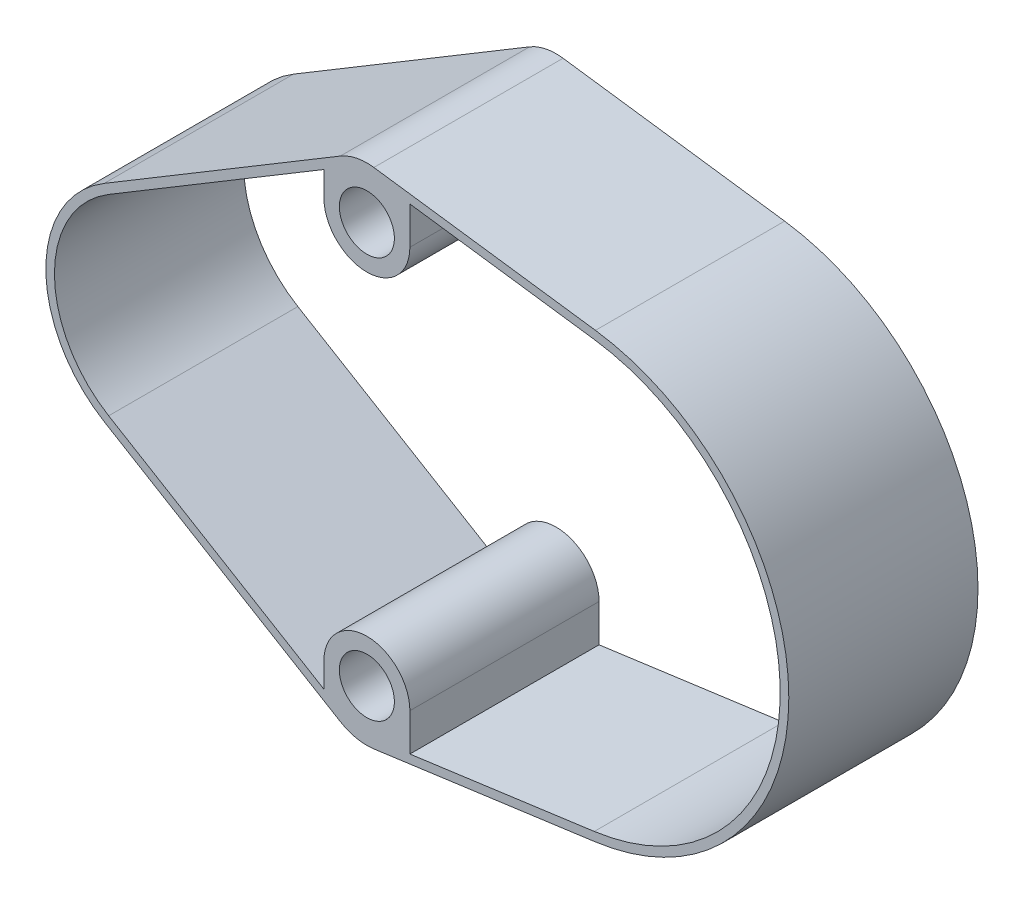
ISO-10303-21;
HEADER;
FILE_DESCRIPTION(('STEP AP214'),'2;1');
FILE_NAME('part.step','',(''),(''),'','','');
FILE_SCHEMA(('AUTOMOTIVE_DESIGN { 1 0 10303 214 1 1 1 1 }'));
ENDSEC;
DATA;
#1=APPLICATION_CONTEXT('core data for automotive mechanical design processes');
#2=APPLICATION_PROTOCOL_DEFINITION('international standard','automotive_design',2000,#1);
#3=PRODUCT_CONTEXT('',#1,'mechanical');
#4=PRODUCT('Part','Part','',(#3));
#5=PRODUCT_RELATED_PRODUCT_CATEGORY('part','',(#4));
#6=PRODUCT_DEFINITION_FORMATION('','',#4);
#7=PRODUCT_DEFINITION_CONTEXT('part definition',#1,'design');
#8=PRODUCT_DEFINITION('design','',#6,#7);
#9=PRODUCT_DEFINITION_SHAPE('','',#8);
#10=(LENGTH_UNIT() NAMED_UNIT(*) SI_UNIT(.MILLI.,.METRE.));
#11=(NAMED_UNIT(*) PLANE_ANGLE_UNIT() SI_UNIT($,.RADIAN.));
#12=(NAMED_UNIT(*) SI_UNIT($,.STERADIAN.) SOLID_ANGLE_UNIT());
#13=UNCERTAINTY_MEASURE_WITH_UNIT(LENGTH_MEASURE(1.E-05),#10,'distance_accuracy_value','');
#14=(GEOMETRIC_REPRESENTATION_CONTEXT(3) GLOBAL_UNCERTAINTY_ASSIGNED_CONTEXT((#13)) GLOBAL_UNIT_ASSIGNED_CONTEXT((#10,
#11,#12)) REPRESENTATION_CONTEXT('',''));
#15=CARTESIAN_POINT('',(0.,0.,0.));
#16=DIRECTION('',(0.,0.,1.));
#17=DIRECTION('',(1.,0.,0.));
#18=AXIS2_PLACEMENT_3D('',#15,#16,#17);
#19=CARTESIAN_POINT('',(11.667261889578,11.667261889578,1.6));
#20=DIRECTION('',(0.,0.,-1.));
#21=DIRECTION('',(-1.,0.,0.));
#22=AXIS2_PLACEMENT_3D('',#19,#20,#21);
#23=CYLINDRICAL_SURFACE('',#22,3.);
#24=DIRECTION('',(0.,0.,-1.));
#25=VECTOR('',#24,1.);
#26=CARTESIAN_POINT('',(12.0730700536144,14.6396884629355,1.6));
#27=LINE('',#26,#25);
#28=CARTESIAN_POINT('',(12.0730700536144,14.6396884629355,14.1));
#29=VERTEX_POINT('',#28);
#30=CARTESIAN_POINT('',(12.0730700536144,14.6396884629355,3.1));
#31=VERTEX_POINT('',#30);
#32=EDGE_CURVE('E139',#29,#31,#27,.T.);
#33=ORIENTED_EDGE('',*,*,#32,.T.);
#34=CARTESIAN_POINT('',(11.667261889578,11.667261889578,3.1));
#35=DIRECTION('',(0.,0.,1.));
#36=DIRECTION('',(1.,0.,0.));
#37=AXIS2_PLACEMENT_3D('',#34,#35,#36);
#38=CIRCLE('',#37,3.);
#39=CARTESIAN_POINT('',(10.1234792899552,14.239563443654,3.1));
#40=VERTEX_POINT('',#39);
#41=EDGE_CURVE('E307',#31,#40,#38,.T.);
#42=ORIENTED_EDGE('',*,*,#41,.T.);
#43=DIRECTION('',(0.,0.,1.));
#44=VECTOR('',#43,1.);
#45=CARTESIAN_POINT('',(10.1234792899552,14.239563443654,-34.868952865985));
#46=LINE('',#45,#44);
#47=CARTESIAN_POINT('',(10.1234792899552,14.239563443654,14.1));
#48=VERTEX_POINT('',#47);
#49=EDGE_CURVE('E161',#40,#48,#46,.T.);
#50=ORIENTED_EDGE('',*,*,#49,.T.);
#51=CARTESIAN_POINT('',(11.667261889578,11.667261889578,14.1));
#52=DIRECTION('',(0.,0.,1.));
#53=DIRECTION('',(1.,0.,0.));
#54=AXIS2_PLACEMENT_3D('',#51,#52,#53);
#55=CIRCLE('',#54,3.);
#56=EDGE_CURVE('E155',#29,#48,#55,.T.);
#57=ORIENTED_EDGE('',*,*,#56,.F.);
#58=EDGE_LOOP('',(#33,#42,#50,#57));
#59=FACE_BOUND('',#58,.T.);
#60=ADVANCED_FACE('F35',(#59),#23,.T.);
#61=CARTESIAN_POINT('',(11.667261889578,-11.667261889578,1.6));
#62=DIRECTION('',(0.,0.,-1.));
#63=DIRECTION('',(-1.,0.,0.));
#64=AXIS2_PLACEMENT_3D('',#61,#62,#63);
#65=CYLINDRICAL_SURFACE('',#64,3.);
#66=DIRECTION('',(0.,0.,1.));
#67=VECTOR('',#66,1.);
#68=CARTESIAN_POINT('',(10.1234792899552,-14.239563443654,-34.868952865985));
#69=LINE('',#68,#67);
#70=CARTESIAN_POINT('',(10.1234792899552,-14.239563443654,3.1));
#71=VERTEX_POINT('',#70);
#72=CARTESIAN_POINT('',(10.1234792899552,-14.239563443654,14.1));
#73=VERTEX_POINT('',#72);
#74=EDGE_CURVE('E237',#71,#73,#69,.T.);
#75=ORIENTED_EDGE('',*,*,#74,.F.);
#76=CARTESIAN_POINT('',(11.667261889578,-11.667261889578,3.1));
#77=DIRECTION('',(0.,0.,1.));
#78=DIRECTION('',(1.,0.,0.));
#79=AXIS2_PLACEMENT_3D('',#76,#77,#78);
#80=CIRCLE('',#79,3.);
#81=CARTESIAN_POINT('',(12.0730700536144,-14.6396884629355,3.1));
#82=VERTEX_POINT('',#81);
#83=EDGE_CURVE('E309',#71,#82,#80,.T.);
#84=ORIENTED_EDGE('',*,*,#83,.T.);
#85=DIRECTION('',(0.,0.,-1.));
#86=VECTOR('',#85,1.);
#87=CARTESIAN_POINT('',(12.0730700536144,-14.6396884629355,1.6));
#88=LINE('',#87,#86);
#89=CARTESIAN_POINT('',(12.0730700536144,-14.6396884629355,14.1));
#90=VERTEX_POINT('',#89);
#91=EDGE_CURVE('E11',#90,#82,#88,.T.);
#92=ORIENTED_EDGE('',*,*,#91,.F.);
#93=CARTESIAN_POINT('',(11.667261889578,-11.667261889578,14.1));
#94=DIRECTION('',(0.,0.,1.));
#95=DIRECTION('',(1.,0.,0.));
#96=AXIS2_PLACEMENT_3D('',#93,#94,#95);
#97=CIRCLE('',#96,3.);
#98=EDGE_CURVE('E254',#73,#90,#97,.T.);
#99=ORIENTED_EDGE('',*,*,#98,.F.);
#100=EDGE_LOOP('',(#75,#84,#92,#99));
#101=FACE_BOUND('',#100,.T.);
#102=ADVANCED_FACE('F334',(#101),#65,.T.);
#103=CARTESIAN_POINT('',(12.0730700536144,-14.6396884629355,1.6));
#104=DIRECTION('',(-0.135269388012114,0.990808857785813,0.));
#105=DIRECTION('',(-0.990808857785813,-0.135269388012114,0.));
#106=AXIS2_PLACEMENT_3D('',#103,#104,#105);
#107=PLANE('',#106);
#108=ORIENTED_EDGE('',*,*,#91,.T.);
#109=DIRECTION('',(0.990808857785813,0.135269388012114,0.));
#110=VECTOR('',#109,1.);
#111=CARTESIAN_POINT('',(12.0730700536144,-14.6396884629355,3.1));
#112=LINE('',#111,#110);
#113=CARTESIAN_POINT('',(24.9585020441575,-12.8805151512156,3.1));
#114=VERTEX_POINT('',#113);
#115=EDGE_CURVE('E250',#82,#114,#112,.T.);
#116=ORIENTED_EDGE('',*,*,#115,.T.);
#117=DIRECTION('',(0.,0.,-1.));
#118=VECTOR('',#117,1.);
#119=CARTESIAN_POINT('',(24.9585020441575,-12.8805151512156,1.6));
#120=LINE('',#119,#118);
#121=CARTESIAN_POINT('',(24.9585020441575,-12.8805151512156,14.1));
#122=VERTEX_POINT('',#121);
#123=EDGE_CURVE('E42',#122,#114,#120,.T.);
#124=ORIENTED_EDGE('',*,*,#123,.F.);
#125=DIRECTION('',(0.990808857785813,0.135269388012114,0.));
#126=VECTOR('',#125,1.);
#127=CARTESIAN_POINT('',(2.18301117428707,-15.9899208528639,14.1));
#128=LINE('',#127,#126);
#129=EDGE_CURVE('E249',#90,#122,#128,.T.);
#130=ORIENTED_EDGE('',*,*,#129,.F.);
#131=EDGE_LOOP('',(#108,#116,#124,#130));
#132=FACE_BOUND('',#131,.T.);
#133=ADVANCED_FACE('F248',(#132),#107,.F.);
#134=CARTESIAN_POINT('',(23.2,0.,1.6));
#135=DIRECTION('',(0.,0.,-1.));
#136=DIRECTION('',(-1.,0.,0.));
#137=AXIS2_PLACEMENT_3D('',#134,#135,#136);
#138=CYLINDRICAL_SURFACE('',#137,13.);
#139=ORIENTED_EDGE('',*,*,#123,.T.);
#140=CARTESIAN_POINT('',(23.2,0.,3.1));
#141=DIRECTION('',(0.,0.,1.));
#142=DIRECTION('',(1.,0.,0.));
#143=AXIS2_PLACEMENT_3D('',#140,#141,#142);
#144=CIRCLE('',#143,13.);
#145=CARTESIAN_POINT('',(24.9585020441575,12.8805151512156,3.1));
#146=VERTEX_POINT('',#145);
#147=EDGE_CURVE('E82',#114,#146,#144,.T.);
#148=ORIENTED_EDGE('',*,*,#147,.T.);
#149=DIRECTION('',(0.,0.,-1.));
#150=VECTOR('',#149,1.);
#151=CARTESIAN_POINT('',(24.9585020441575,12.8805151512156,1.6));
#152=LINE('',#151,#150);
#153=CARTESIAN_POINT('',(24.9585020441575,12.8805151512156,14.1));
#154=VERTEX_POINT('',#153);
#155=EDGE_CURVE('E148',#154,#146,#152,.T.);
#156=ORIENTED_EDGE('',*,*,#155,.F.);
#157=CARTESIAN_POINT('',(23.2,0.,14.1));
#158=DIRECTION('',(0.,0.,1.));
#159=DIRECTION('',(1.,0.,0.));
#160=AXIS2_PLACEMENT_3D('',#157,#158,#159);
#161=CIRCLE('',#160,13.);
#162=EDGE_CURVE('E158',#122,#154,#161,.T.);
#163=ORIENTED_EDGE('',*,*,#162,.F.);
#164=EDGE_LOOP('',(#139,#148,#156,#163));
#165=FACE_BOUND('',#164,.T.);
#166=ADVANCED_FACE('F245',(#165),#138,.T.);
#167=CARTESIAN_POINT('',(12.0730700536144,14.6396884629355,1.6));
#168=DIRECTION('',(-0.135269388012114,-0.990808857785813,0.));
#169=DIRECTION('',(0.990808857785813,-0.135269388012114,0.));
#170=AXIS2_PLACEMENT_3D('',#167,#168,#169);
#171=PLANE('',#170);
#172=ORIENTED_EDGE('',*,*,#155,.T.);
#173=DIRECTION('',(-0.990808857785813,0.135269388012114,0.));
#174=VECTOR('',#173,1.);
#175=CARTESIAN_POINT('',(12.0730700536144,14.6396884629355,3.1));
#176=LINE('',#175,#174);
#177=EDGE_CURVE('E144',#146,#31,#176,.T.);
#178=ORIENTED_EDGE('',*,*,#177,.T.);
#179=ORIENTED_EDGE('',*,*,#32,.F.);
#180=DIRECTION('',(-0.990808857785813,0.135269388012114,0.));
#181=VECTOR('',#180,1.);
#182=CARTESIAN_POINT('',(2.18301117428706,15.9899208528639,14.1));
#183=LINE('',#182,#181);
#184=EDGE_CURVE('E143',#154,#29,#183,.T.);
#185=ORIENTED_EDGE('',*,*,#184,.F.);
#186=EDGE_LOOP('',(#172,#178,#179,#185));
#187=FACE_BOUND('',#186,.T.);
#188=ADVANCED_FACE('F142',(#187),#171,.F.);
#189=CARTESIAN_POINT('',(11.667261889578,11.667261889578,1.6));
#190=DIRECTION('',(0.,0.,-1.));
#191=DIRECTION('',(-1.,0.,0.));
#192=AXIS2_PLACEMENT_3D('',#189,#190,#191);
#193=CYLINDRICAL_SURFACE('',#192,1.6);
#194=CARTESIAN_POINT('',(11.667261889578,11.667261889578,3.1));
#195=DIRECTION('',(0.,0.,1.));
#196=DIRECTION('',(1.,0.,0.));
#197=AXIS2_PLACEMENT_3D('',#194,#195,#196);
#198=CIRCLE('',#197,1.6);
#199=CARTESIAN_POINT('',(13.267261889578,11.667261889578,3.1));
#200=VERTEX_POINT('',#199);
#201=EDGE_CURVE('E170',#200,#200,#198,.T.);
#202=ORIENTED_EDGE('',*,*,#201,.F.);
#203=EDGE_LOOP('',(#202));
#204=FACE_BOUND('',#203,.T.);
#205=CARTESIAN_POINT('',(11.667261889578,11.667261889578,14.1));
#206=DIRECTION('',(0.,0.,1.));
#207=DIRECTION('',(1.,0.,0.));
#208=AXIS2_PLACEMENT_3D('',#205,#206,#207);
#209=CIRCLE('',#208,1.6);
#210=CARTESIAN_POINT('',(13.267261889578,11.667261889578,14.1));
#211=VERTEX_POINT('',#210);
#212=EDGE_CURVE('E265',#211,#211,#209,.F.);
#213=ORIENTED_EDGE('',*,*,#212,.F.);
#214=EDGE_LOOP('',(#213));
#215=FACE_BOUND('',#214,.T.);
#216=ADVANCED_FACE('F421',(#204,#215),#193,.F.);
#217=CARTESIAN_POINT('',(11.667261889578,-11.667261889578,1.6));
#218=DIRECTION('',(0.,0.,-1.));
#219=DIRECTION('',(-1.,0.,0.));
#220=AXIS2_PLACEMENT_3D('',#217,#218,#219);
#221=CYLINDRICAL_SURFACE('',#220,1.6);
#222=CARTESIAN_POINT('',(11.667261889578,-11.667261889578,3.1));
#223=DIRECTION('',(0.,0.,1.));
#224=DIRECTION('',(1.,0.,0.));
#225=AXIS2_PLACEMENT_3D('',#222,#223,#224);
#226=CIRCLE('',#225,1.6);
#227=CARTESIAN_POINT('',(13.267261889578,-11.667261889578,3.1));
#228=VERTEX_POINT('',#227);
#229=EDGE_CURVE('E301',#228,#228,#226,.T.);
#230=ORIENTED_EDGE('',*,*,#229,.F.);
#231=EDGE_LOOP('',(#230));
#232=FACE_BOUND('',#231,.T.);
#233=CARTESIAN_POINT('',(11.667261889578,-11.667261889578,14.1));
#234=DIRECTION('',(0.,0.,1.));
#235=DIRECTION('',(1.,0.,0.));
#236=AXIS2_PLACEMENT_3D('',#233,#234,#235);
#237=CIRCLE('',#236,1.6);
#238=CARTESIAN_POINT('',(13.267261889578,-11.667261889578,14.1));
#239=VERTEX_POINT('',#238);
#240=EDGE_CURVE('E262',#239,#239,#237,.F.);
#241=ORIENTED_EDGE('',*,*,#240,.F.);
#242=EDGE_LOOP('',(#241));
#243=FACE_BOUND('',#242,.T.);
#244=ADVANCED_FACE('F419',(#232,#243),#221,.F.);
#245=CARTESIAN_POINT('',(-3.60215939911994,-6.00203695951065,-34.868952865985));
#246=DIRECTION('',(-0.514594199874278,-0.857433851358664,0.));
#247=DIRECTION('',(0.857433851358664,-0.514594199874278,0.));
#248=AXIS2_PLACEMENT_3D('',#245,#246,#247);
#249=PLANE('',#248);
#250=DIRECTION('',(-0.857433851358664,0.514594199874278,0.));
#251=VECTOR('',#250,1.);
#252=CARTESIAN_POINT('',(-3.60215939911994,-6.00203695951065,3.1));
#253=LINE('',#252,#251);
#254=CARTESIAN_POINT('',(-3.60215939911994,-6.00203695951065,3.1));
#255=VERTEX_POINT('',#254);
#256=EDGE_CURVE('E312',#71,#255,#253,.T.);
#257=ORIENTED_EDGE('',*,*,#256,.F.);
#258=ORIENTED_EDGE('',*,*,#74,.T.);
#259=DIRECTION('',(0.857433851358665,-0.514594199874278,0.));
#260=VECTOR('',#259,1.);
#261=CARTESIAN_POINT('',(-3.60215939911994,-6.00203695951065,14.1));
#262=LINE('',#261,#260);
#263=CARTESIAN_POINT('',(-3.60215939911994,-6.00203695951065,14.1));
#264=VERTEX_POINT('',#263);
#265=EDGE_CURVE('E256',#264,#73,#262,.T.);
#266=ORIENTED_EDGE('',*,*,#265,.F.);
#267=DIRECTION('',(0.,0.,1.));
#268=VECTOR('',#267,1.);
#269=CARTESIAN_POINT('',(-3.60215939911994,-6.00203695951065,-34.868952865985));
#270=LINE('',#269,#268);
#271=EDGE_CURVE('E239',#255,#264,#270,.T.);
#272=ORIENTED_EDGE('',*,*,#271,.F.);
#273=EDGE_LOOP('',(#257,#258,#266,#272));
#274=FACE_BOUND('',#273,.T.);
#275=ADVANCED_FACE('F331',(#274),#249,.T.);
#276=CARTESIAN_POINT('',(0.,0.,-34.868952865985));
#277=DIRECTION('',(0.,0.,1.));
#278=DIRECTION('',(1.,0.,0.));
#279=AXIS2_PLACEMENT_3D('',#276,#277,#278);
#280=CYLINDRICAL_SURFACE('',#279,7.);
#281=CARTESIAN_POINT('',(0.,0.,3.1));
#282=DIRECTION('',(0.,0.,1.));
#283=DIRECTION('',(1.,0.,0.));
#284=AXIS2_PLACEMENT_3D('',#281,#282,#283);
#285=CIRCLE('',#284,7.);
#286=CARTESIAN_POINT('',(-3.60215939911994,6.00203695951065,3.1));
#287=VERTEX_POINT('',#286);
#288=EDGE_CURVE('E49',#255,#287,#285,.F.);
#289=ORIENTED_EDGE('',*,*,#288,.F.);
#290=ORIENTED_EDGE('',*,*,#271,.T.);
#291=CARTESIAN_POINT('',(0.,0.,14.1));
#292=DIRECTION('',(0.,0.,1.));
#293=DIRECTION('',(1.,0.,0.));
#294=AXIS2_PLACEMENT_3D('',#291,#292,#293);
#295=CIRCLE('',#294,7.);
#296=CARTESIAN_POINT('',(-3.60215939911994,6.00203695951065,14.1));
#297=VERTEX_POINT('',#296);
#298=EDGE_CURVE('E260',#297,#264,#295,.T.);
#299=ORIENTED_EDGE('',*,*,#298,.F.);
#300=DIRECTION('',(0.,0.,1.));
#301=VECTOR('',#300,1.);
#302=CARTESIAN_POINT('',(-3.60215939911994,6.00203695951065,-34.868952865985));
#303=LINE('',#302,#301);
#304=EDGE_CURVE('E57',#287,#297,#303,.T.);
#305=ORIENTED_EDGE('',*,*,#304,.F.);
#306=EDGE_LOOP('',(#289,#290,#299,#305));
#307=FACE_BOUND('',#306,.T.);
#308=ADVANCED_FACE('F326',(#307),#280,.T.);
#309=CARTESIAN_POINT('',(-3.60215939911994,6.00203695951065,-34.868952865985));
#310=DIRECTION('',(-0.514594199874278,0.857433851358664,0.));
#311=DIRECTION('',(-0.857433851358664,-0.514594199874278,0.));
#312=AXIS2_PLACEMENT_3D('',#309,#310,#311);
#313=PLANE('',#312);
#314=DIRECTION('',(0.857433851358664,0.514594199874278,0.));
#315=VECTOR('',#314,1.);
#316=CARTESIAN_POINT('',(-3.60215939911994,6.00203695951065,3.1));
#317=LINE('',#316,#315);
#318=EDGE_CURVE('E315',#287,#40,#317,.T.);
#319=ORIENTED_EDGE('',*,*,#318,.F.);
#320=ORIENTED_EDGE('',*,*,#304,.T.);
#321=DIRECTION('',(-0.857433851358665,-0.514594199874278,0.));
#322=VECTOR('',#321,1.);
#323=CARTESIAN_POINT('',(-3.60215939911994,6.00203695951065,14.1));
#324=LINE('',#323,#322);
#325=EDGE_CURVE('E162',#48,#297,#324,.T.);
#326=ORIENTED_EDGE('',*,*,#325,.F.);
#327=ORIENTED_EDGE('',*,*,#49,.F.);
#328=EDGE_LOOP('',(#319,#320,#326,#327));
#329=FACE_BOUND('',#328,.T.);
#330=ADVANCED_FACE('F323',(#329),#313,.T.);
#331=CARTESIAN_POINT('',(11.667261889578,-11.667261889578,14.1));
#332=DIRECTION('',(0.,0.,-1.));
#333=DIRECTION('',(-1.,0.,0.));
#334=AXIS2_PLACEMENT_3D('',#331,#332,#333);
#335=CYLINDRICAL_SURFACE('',#334,2.5);
#336=CARTESIAN_POINT('',(11.667261889578,-11.667261889578,3.1));
#337=DIRECTION('',(0.,0.,1.));
#338=DIRECTION('',(1.,0.,0.));
#339=AXIS2_PLACEMENT_3D('',#336,#337,#338);
#340=CIRCLE('',#339,2.5);
#341=CARTESIAN_POINT('',(9.16726188957803,-11.667261889578,3.1));
#342=VERTEX_POINT('',#341);
#343=CARTESIAN_POINT('',(14.167261889578,-11.667261889578,3.1));
#344=VERTEX_POINT('',#343);
#345=EDGE_CURVE('E71',#342,#344,#340,.F.);
#346=ORIENTED_EDGE('',*,*,#345,.F.);
#347=DIRECTION('',(0.,0.,-1.));
#348=VECTOR('',#347,1.);
#349=CARTESIAN_POINT('',(9.16726188957803,-11.667261889578,14.1));
#350=LINE('',#349,#348);
#351=CARTESIAN_POINT('',(9.16726188957803,-11.667261889578,14.1));
#352=VERTEX_POINT('',#351);
#353=EDGE_CURVE('E234',#352,#342,#350,.T.);
#354=ORIENTED_EDGE('',*,*,#353,.F.);
#355=CARTESIAN_POINT('',(11.667261889578,-11.667261889578,14.1));
#356=DIRECTION('',(0.,0.,1.));
#357=DIRECTION('',(1.,0.,0.));
#358=AXIS2_PLACEMENT_3D('',#355,#356,#357);
#359=CIRCLE('',#358,2.5);
#360=CARTESIAN_POINT('',(14.167261889578,-11.667261889578,14.1));
#361=VERTEX_POINT('',#360);
#362=EDGE_CURVE('E202',#352,#361,#359,.F.);
#363=ORIENTED_EDGE('',*,*,#362,.T.);
#364=DIRECTION('',(0.,0.,-1.));
#365=VECTOR('',#364,1.);
#366=CARTESIAN_POINT('',(14.167261889578,-11.667261889578,14.1));
#367=LINE('',#366,#365);
#368=EDGE_CURVE('E164',#361,#344,#367,.T.);
#369=ORIENTED_EDGE('',*,*,#368,.T.);
#370=EDGE_LOOP('',(#346,#354,#363,#369));
#371=FACE_BOUND('',#370,.T.);
#372=ADVANCED_FACE('F410',(#371),#335,.T.);
#373=CARTESIAN_POINT('',(9.16726188957916,-8.86829933341991E-13,14.1));
#374=DIRECTION('',(1.,0.,0.));
#375=DIRECTION('',(0.,1.,0.));
#376=AXIS2_PLACEMENT_3D('',#373,#374,#375);
#377=PLANE('',#376);
#378=DIRECTION('',(0.,-1.,0.));
#379=VECTOR('',#378,1.);
#380=CARTESIAN_POINT('',(9.16726188957916,-8.86829933341991E-13,3.1));
#381=LINE('',#380,#379);
#382=CARTESIAN_POINT('',(9.1672618895779,-13.0838925660797,3.1));
#383=VERTEX_POINT('',#382);
#384=EDGE_CURVE('E169',#342,#383,#381,.T.);
#385=ORIENTED_EDGE('',*,*,#384,.T.);
#386=DIRECTION('',(0.,0.,-1.));
#387=VECTOR('',#386,1.);
#388=CARTESIAN_POINT('',(9.1672618895779,-13.0838925660797,14.1));
#389=LINE('',#388,#387);
#390=CARTESIAN_POINT('',(9.1672618895779,-13.0838925660797,14.1));
#391=VERTEX_POINT('',#390);
#392=EDGE_CURVE('E231',#391,#383,#389,.T.);
#393=ORIENTED_EDGE('',*,*,#392,.F.);
#394=DIRECTION('',(0.,-1.,0.));
#395=VECTOR('',#394,1.);
#396=CARTESIAN_POINT('',(9.16726188957916,-8.86829933341991E-13,14.1));
#397=LINE('',#396,#395);
#398=EDGE_CURVE('E295',#352,#391,#397,.T.);
#399=ORIENTED_EDGE('',*,*,#398,.F.);
#400=ORIENTED_EDGE('',*,*,#353,.T.);
#401=EDGE_LOOP('',(#385,#393,#399,#400));
#402=FACE_BOUND('',#401,.T.);
#403=ADVANCED_FACE('F407',(#402),#377,.F.);
#404=CARTESIAN_POINT('',(-3.34534100876561,-5.57337126377146,14.1));
#405=DIRECTION('',(0.51464486434892,0.857403442726516,0.));
#406=DIRECTION('',(-0.857403442726516,0.51464486434892,0.));
#407=AXIS2_PLACEMENT_3D('',#404,#405,#406);
#408=PLANE('',#407);
#409=DIRECTION('',(0.857403442726516,-0.51464486434892,0.));
#410=VECTOR('',#409,1.);
#411=CARTESIAN_POINT('',(-3.34534100876561,-5.57337126377146,3.1));
#412=LINE('',#411,#410);
#413=CARTESIAN_POINT('',(-3.34534100876558,-5.57337126377148,3.1));
#414=VERTEX_POINT('',#413);
#415=EDGE_CURVE('E173',#414,#383,#412,.T.);
#416=ORIENTED_EDGE('',*,*,#415,.F.);
#417=DIRECTION('',(0.,0.,-1.));
#418=VECTOR('',#417,1.);
#419=CARTESIAN_POINT('',(-3.34534100876558,-5.57337126377148,14.1));
#420=LINE('',#419,#418);
#421=CARTESIAN_POINT('',(-3.34534100876558,-5.57337126377148,14.1));
#422=VERTEX_POINT('',#421);
#423=EDGE_CURVE('E228',#422,#414,#420,.T.);
#424=ORIENTED_EDGE('',*,*,#423,.F.);
#425=DIRECTION('',(0.857403442726516,-0.51464486434892,0.));
#426=VECTOR('',#425,1.);
#427=CARTESIAN_POINT('',(-3.34534100876561,-5.57337126377146,14.1));
#428=LINE('',#427,#426);
#429=EDGE_CURVE('E292',#422,#391,#428,.T.);
#430=ORIENTED_EDGE('',*,*,#429,.T.);
#431=ORIENTED_EDGE('',*,*,#392,.T.);
#432=EDGE_LOOP('',(#416,#424,#430,#431));
#433=FACE_BOUND('',#432,.T.);
#434=ADVANCED_FACE('F403',(#433),#408,.T.);
#435=CARTESIAN_POINT('',(0.,0.,14.1));
#436=DIRECTION('',(0.,0.,-1.));
#437=DIRECTION('',(-1.,0.,0.));
#438=AXIS2_PLACEMENT_3D('',#435,#436,#437);
#439=CYLINDRICAL_SURFACE('',#438,6.50029027880774);
#440=CARTESIAN_POINT('',(0.,0.,3.1));
#441=DIRECTION('',(0.,0.,1.));
#442=DIRECTION('',(1.,0.,0.));
#443=AXIS2_PLACEMENT_3D('',#440,#441,#442);
#444=CIRCLE('',#443,6.50029027880774);
#445=CARTESIAN_POINT('',(-3.3453410087655,5.57337126377152,3.1));
#446=VERTEX_POINT('',#445);
#447=EDGE_CURVE('E176',#446,#414,#444,.T.);
#448=ORIENTED_EDGE('',*,*,#447,.F.);
#449=DIRECTION('',(0.,0.,-1.));
#450=VECTOR('',#449,1.);
#451=CARTESIAN_POINT('',(-3.3453410087655,5.57337126377152,14.1));
#452=LINE('',#451,#450);
#453=CARTESIAN_POINT('',(-3.3453410087655,5.57337126377152,14.1));
#454=VERTEX_POINT('',#453);
#455=EDGE_CURVE('E225',#454,#446,#452,.T.);
#456=ORIENTED_EDGE('',*,*,#455,.F.);
#457=CARTESIAN_POINT('',(0.,0.,14.1));
#458=DIRECTION('',(0.,0.,1.));
#459=DIRECTION('',(1.,0.,0.));
#460=AXIS2_PLACEMENT_3D('',#457,#458,#459);
#461=CIRCLE('',#460,6.50029027880774);
#462=EDGE_CURVE('E289',#454,#422,#461,.T.);
#463=ORIENTED_EDGE('',*,*,#462,.T.);
#464=ORIENTED_EDGE('',*,*,#423,.T.);
#465=EDGE_LOOP('',(#448,#456,#463,#464));
#466=FACE_BOUND('',#465,.T.);
#467=ADVANCED_FACE('F399',(#466),#439,.F.);
#468=CARTESIAN_POINT('',(-3.34534100876558,5.57337126377147,14.1));
#469=DIRECTION('',(0.514644864348916,-0.857403442726518,0.));
#470=DIRECTION('',(0.857403442726518,0.514644864348916,0.));
#471=AXIS2_PLACEMENT_3D('',#468,#469,#470);
#472=PLANE('',#471);
#473=DIRECTION('',(-0.857403442726518,-0.514644864348916,0.));
#474=VECTOR('',#473,1.);
#475=CARTESIAN_POINT('',(-3.34534100876558,5.57337126377147,3.1));
#476=LINE('',#475,#474);
#477=CARTESIAN_POINT('',(9.16726188957793,13.0838925660796,3.1));
#478=VERTEX_POINT('',#477);
#479=EDGE_CURVE('E179',#478,#446,#476,.T.);
#480=ORIENTED_EDGE('',*,*,#479,.F.);
#481=DIRECTION('',(0.,0.,-1.));
#482=VECTOR('',#481,1.);
#483=CARTESIAN_POINT('',(9.16726188957793,13.0838925660796,14.1));
#484=LINE('',#483,#482);
#485=CARTESIAN_POINT('',(9.16726188957793,13.0838925660796,14.1));
#486=VERTEX_POINT('',#485);
#487=EDGE_CURVE('E222',#486,#478,#484,.T.);
#488=ORIENTED_EDGE('',*,*,#487,.F.);
#489=DIRECTION('',(-0.857403442726518,-0.514644864348916,0.));
#490=VECTOR('',#489,1.);
#491=CARTESIAN_POINT('',(-3.34534100876558,5.57337126377147,14.1));
#492=LINE('',#491,#490);
#493=EDGE_CURVE('E286',#486,#454,#492,.T.);
#494=ORIENTED_EDGE('',*,*,#493,.T.);
#495=ORIENTED_EDGE('',*,*,#455,.T.);
#496=EDGE_LOOP('',(#480,#488,#494,#495));
#497=FACE_BOUND('',#496,.T.);
#498=ADVANCED_FACE('F395',(#497),#472,.T.);
#499=CARTESIAN_POINT('',(9.16726188957886,6.5109033080805E-13,14.1));
#500=DIRECTION('',(-1.,0.,0.));
#501=DIRECTION('',(0.,-1.,0.));
#502=AXIS2_PLACEMENT_3D('',#499,#500,#501);
#503=PLANE('',#502);
#504=DIRECTION('',(0.,1.,0.));
#505=VECTOR('',#504,1.);
#506=CARTESIAN_POINT('',(9.16726188957886,6.5109033080805E-13,3.1));
#507=LINE('',#506,#505);
#508=CARTESIAN_POINT('',(9.16726188957803,11.667261889578,3.1));
#509=VERTEX_POINT('',#508);
#510=EDGE_CURVE('E182',#509,#478,#507,.T.);
#511=ORIENTED_EDGE('',*,*,#510,.F.);
#512=DIRECTION('',(0.,0.,-1.));
#513=VECTOR('',#512,1.);
#514=CARTESIAN_POINT('',(9.16726188957803,11.667261889578,14.1));
#515=LINE('',#514,#513);
#516=CARTESIAN_POINT('',(9.16726188957803,11.667261889578,14.1));
#517=VERTEX_POINT('',#516);
#518=EDGE_CURVE('E219',#517,#509,#515,.T.);
#519=ORIENTED_EDGE('',*,*,#518,.F.);
#520=DIRECTION('',(0.,1.,0.));
#521=VECTOR('',#520,1.);
#522=CARTESIAN_POINT('',(9.16726188957886,6.5109033080805E-13,14.1));
#523=LINE('',#522,#521);
#524=EDGE_CURVE('E283',#517,#486,#523,.T.);
#525=ORIENTED_EDGE('',*,*,#524,.T.);
#526=ORIENTED_EDGE('',*,*,#487,.T.);
#527=EDGE_LOOP('',(#511,#519,#525,#526));
#528=FACE_BOUND('',#527,.T.);
#529=ADVANCED_FACE('F392',(#528),#503,.T.);
#530=CARTESIAN_POINT('',(11.667261889578,11.667261889578,14.1));
#531=DIRECTION('',(0.,0.,-1.));
#532=DIRECTION('',(-1.,0.,0.));
#533=AXIS2_PLACEMENT_3D('',#530,#531,#532);
#534=CYLINDRICAL_SURFACE('',#533,2.5);
#535=CARTESIAN_POINT('',(11.667261889578,11.667261889578,3.1));
#536=DIRECTION('',(0.,0.,1.));
#537=DIRECTION('',(1.,0.,0.));
#538=AXIS2_PLACEMENT_3D('',#535,#536,#537);
#539=CIRCLE('',#538,2.5);
#540=CARTESIAN_POINT('',(14.167261889578,11.667261889578,3.1));
#541=VERTEX_POINT('',#540);
#542=EDGE_CURVE('E185',#509,#541,#539,.T.);
#543=ORIENTED_EDGE('',*,*,#542,.T.);
#544=DIRECTION('',(0.,0.,-1.));
#545=VECTOR('',#544,1.);
#546=CARTESIAN_POINT('',(14.167261889578,11.667261889578,14.1));
#547=LINE('',#546,#545);
#548=CARTESIAN_POINT('',(14.167261889578,11.667261889578,14.1));
#549=VERTEX_POINT('',#548);
#550=EDGE_CURVE('E216',#549,#541,#547,.T.);
#551=ORIENTED_EDGE('',*,*,#550,.F.);
#552=CARTESIAN_POINT('',(11.667261889578,11.667261889578,14.1));
#553=DIRECTION('',(0.,0.,1.));
#554=DIRECTION('',(1.,0.,0.));
#555=AXIS2_PLACEMENT_3D('',#552,#553,#554);
#556=CIRCLE('',#555,2.5);
#557=EDGE_CURVE('E281',#517,#549,#556,.T.);
#558=ORIENTED_EDGE('',*,*,#557,.F.);
#559=ORIENTED_EDGE('',*,*,#518,.T.);
#560=EDGE_LOOP('',(#543,#551,#558,#559));
#561=FACE_BOUND('',#560,.T.);
#562=ADVANCED_FACE('F387',(#561),#534,.T.);
#563=CARTESIAN_POINT('',(14.167261889578,0.,14.1));
#564=DIRECTION('',(-1.,0.,0.));
#565=DIRECTION('',(0.,-1.,0.));
#566=AXIS2_PLACEMENT_3D('',#563,#564,#565);
#567=PLANE('',#566);
#568=DIRECTION('',(0.,1.,0.));
#569=VECTOR('',#568,1.);
#570=CARTESIAN_POINT('',(14.167261889578,0.,3.1));
#571=LINE('',#570,#569);
#572=CARTESIAN_POINT('',(14.167261889578,13.8491423935542,3.1));
#573=VERTEX_POINT('',#572);
#574=EDGE_CURVE('E188',#541,#573,#571,.T.);
#575=ORIENTED_EDGE('',*,*,#574,.T.);
#576=DIRECTION('',(0.,0.,-1.));
#577=VECTOR('',#576,1.);
#578=CARTESIAN_POINT('',(14.167261889578,13.8491423935542,14.1));
#579=LINE('',#578,#577);
#580=CARTESIAN_POINT('',(14.167261889578,13.8491423935542,14.1));
#581=VERTEX_POINT('',#580);
#582=EDGE_CURVE('E213',#581,#573,#579,.T.);
#583=ORIENTED_EDGE('',*,*,#582,.F.);
#584=DIRECTION('',(0.,1.,0.));
#585=VECTOR('',#584,1.);
#586=CARTESIAN_POINT('',(14.167261889578,0.,14.1));
#587=LINE('',#586,#585);
#588=EDGE_CURVE('E279',#549,#581,#587,.T.);
#589=ORIENTED_EDGE('',*,*,#588,.F.);
#590=ORIENTED_EDGE('',*,*,#550,.T.);
#591=EDGE_LOOP('',(#575,#583,#589,#590));
#592=FACE_BOUND('',#591,.T.);
#593=ADVANCED_FACE('F383',(#592),#567,.F.);
#594=CARTESIAN_POINT('',(2.11537648028101,15.494516423971,14.1));
#595=DIRECTION('',(-0.135269388012114,-0.990808857785814,0.));
#596=DIRECTION('',(0.990808857785814,-0.135269388012114,0.));
#597=AXIS2_PLACEMENT_3D('',#594,#595,#596);
#598=PLANE('',#597);
#599=DIRECTION('',(-0.990808857785813,0.135269388012114,0.));
#600=VECTOR('',#599,1.);
#601=CARTESIAN_POINT('',(2.11537648028101,15.494516423971,3.1));
#602=LINE('',#601,#600);
#603=CARTESIAN_POINT('',(24.8908673501513,12.3851107223227,3.1));
#604=VERTEX_POINT('',#603);
#605=EDGE_CURVE('E191',#604,#573,#602,.T.);
#606=ORIENTED_EDGE('',*,*,#605,.F.);
#607=DIRECTION('',(0.,0.,-1.));
#608=VECTOR('',#607,1.);
#609=CARTESIAN_POINT('',(24.8908673501513,12.3851107223227,14.1));
#610=LINE('',#609,#608);
#611=CARTESIAN_POINT('',(24.8908673501513,12.3851107223227,14.1));
#612=VERTEX_POINT('',#611);
#613=EDGE_CURVE('E210',#612,#604,#610,.T.);
#614=ORIENTED_EDGE('',*,*,#613,.F.);
#615=DIRECTION('',(-0.990808857785813,0.135269388012114,0.));
#616=VECTOR('',#615,1.);
#617=CARTESIAN_POINT('',(2.11537648028101,15.494516423971,14.1));
#618=LINE('',#617,#616);
#619=EDGE_CURVE('E276',#612,#581,#618,.T.);
#620=ORIENTED_EDGE('',*,*,#619,.T.);
#621=ORIENTED_EDGE('',*,*,#582,.T.);
#622=EDGE_LOOP('',(#606,#614,#620,#621));
#623=FACE_BOUND('',#622,.T.);
#624=ADVANCED_FACE('F379',(#623),#598,.T.);
#625=CARTESIAN_POINT('',(23.2,0.,14.1));
#626=DIRECTION('',(0.,0.,-1.));
#627=DIRECTION('',(-1.,0.,0.));
#628=AXIS2_PLACEMENT_3D('',#625,#626,#627);
#629=CYLINDRICAL_SURFACE('',#628,12.5);
#630=CARTESIAN_POINT('',(23.2,0.,3.1));
#631=DIRECTION('',(0.,0.,1.));
#632=DIRECTION('',(1.,0.,0.));
#633=AXIS2_PLACEMENT_3D('',#630,#631,#632);
#634=CIRCLE('',#633,12.5);
#635=CARTESIAN_POINT('',(24.8908673501514,-12.3851107223227,3.1));
#636=VERTEX_POINT('',#635);
#637=EDGE_CURVE('E194',#636,#604,#634,.T.);
#638=ORIENTED_EDGE('',*,*,#637,.F.);
#639=DIRECTION('',(0.,0.,-1.));
#640=VECTOR('',#639,1.);
#641=CARTESIAN_POINT('',(24.8908673501514,-12.3851107223227,14.1));
#642=LINE('',#641,#640);
#643=CARTESIAN_POINT('',(24.8908673501514,-12.3851107223227,14.1));
#644=VERTEX_POINT('',#643);
#645=EDGE_CURVE('E207',#644,#636,#642,.T.);
#646=ORIENTED_EDGE('',*,*,#645,.F.);
#647=CARTESIAN_POINT('',(23.2,0.,14.1));
#648=DIRECTION('',(0.,0.,1.));
#649=DIRECTION('',(1.,0.,0.));
#650=AXIS2_PLACEMENT_3D('',#647,#648,#649);
#651=CIRCLE('',#650,12.5);
#652=EDGE_CURVE('E273',#644,#612,#651,.T.);
#653=ORIENTED_EDGE('',*,*,#652,.T.);
#654=ORIENTED_EDGE('',*,*,#613,.T.);
#655=EDGE_LOOP('',(#638,#646,#653,#654));
#656=FACE_BOUND('',#655,.T.);
#657=ADVANCED_FACE('F375',(#656),#629,.F.);
#658=CARTESIAN_POINT('',(2.11537648028107,-15.494516423971,14.1));
#659=DIRECTION('',(0.135269388012117,-0.990808857785813,0.));
#660=DIRECTION('',(0.990808857785813,0.135269388012117,0.));
#661=AXIS2_PLACEMENT_3D('',#658,#659,#660);
#662=PLANE('',#661);
#663=DIRECTION('',(-0.990808857785813,-0.135269388012117,0.));
#664=VECTOR('',#663,1.);
#665=CARTESIAN_POINT('',(2.11537648028107,-15.494516423971,3.1));
#666=LINE('',#665,#664);
#667=CARTESIAN_POINT('',(14.167261889578,-13.8491423935542,3.1));
#668=VERTEX_POINT('',#667);
#669=EDGE_CURVE('E197',#636,#668,#666,.T.);
#670=ORIENTED_EDGE('',*,*,#669,.T.);
#671=DIRECTION('',(0.,0.,-1.));
#672=VECTOR('',#671,1.);
#673=CARTESIAN_POINT('',(14.167261889578,-13.8491423935542,14.1));
#674=LINE('',#673,#672);
#675=CARTESIAN_POINT('',(14.167261889578,-13.8491423935542,14.1));
#676=VERTEX_POINT('',#675);
#677=EDGE_CURVE('E204',#676,#668,#674,.T.);
#678=ORIENTED_EDGE('',*,*,#677,.F.);
#679=DIRECTION('',(-0.990808857785813,-0.135269388012117,0.));
#680=VECTOR('',#679,1.);
#681=CARTESIAN_POINT('',(2.11537648028107,-15.494516423971,14.1));
#682=LINE('',#681,#680);
#683=EDGE_CURVE('E271',#644,#676,#682,.T.);
#684=ORIENTED_EDGE('',*,*,#683,.F.);
#685=ORIENTED_EDGE('',*,*,#645,.T.);
#686=EDGE_LOOP('',(#670,#678,#684,#685));
#687=FACE_BOUND('',#686,.T.);
#688=ADVANCED_FACE('F371',(#687),#662,.F.);
#689=CARTESIAN_POINT('',(14.167261889578,0.,14.1));
#690=DIRECTION('',(1.,0.,0.));
#691=DIRECTION('',(0.,1.,0.));
#692=AXIS2_PLACEMENT_3D('',#689,#690,#691);
#693=PLANE('',#692);
#694=DIRECTION('',(0.,-1.,0.));
#695=VECTOR('',#694,1.);
#696=CARTESIAN_POINT('',(14.167261889578,0.,3.1));
#697=LINE('',#696,#695);
#698=EDGE_CURVE('E200',#344,#668,#697,.T.);
#699=ORIENTED_EDGE('',*,*,#698,.F.);
#700=ORIENTED_EDGE('',*,*,#368,.F.);
#701=DIRECTION('',(0.,-1.,0.));
#702=VECTOR('',#701,1.);
#703=CARTESIAN_POINT('',(14.167261889578,0.,14.1));
#704=LINE('',#703,#702);
#705=EDGE_CURVE('E268',#361,#676,#704,.T.);
#706=ORIENTED_EDGE('',*,*,#705,.T.);
#707=ORIENTED_EDGE('',*,*,#677,.T.);
#708=EDGE_LOOP('',(#699,#700,#706,#707));
#709=FACE_BOUND('',#708,.T.);
#710=ADVANCED_FACE('F367',(#709),#693,.T.);
#711=CARTESIAN_POINT('',(0.,0.,14.1));
#712=DIRECTION('',(0.,0.,1.));
#713=DIRECTION('',(1.,0.,0.));
#714=AXIS2_PLACEMENT_3D('',#711,#712,#713);
#715=PLANE('',#714);
#716=ORIENTED_EDGE('',*,*,#362,.F.);
#717=ORIENTED_EDGE('',*,*,#398,.T.);
#718=ORIENTED_EDGE('',*,*,#429,.F.);
#719=ORIENTED_EDGE('',*,*,#462,.F.);
#720=ORIENTED_EDGE('',*,*,#493,.F.);
#721=ORIENTED_EDGE('',*,*,#524,.F.);
#722=ORIENTED_EDGE('',*,*,#557,.T.);
#723=ORIENTED_EDGE('',*,*,#588,.T.);
#724=ORIENTED_EDGE('',*,*,#619,.F.);
#725=ORIENTED_EDGE('',*,*,#652,.F.);
#726=ORIENTED_EDGE('',*,*,#683,.T.);
#727=ORIENTED_EDGE('',*,*,#705,.F.);
#728=EDGE_LOOP('',(#716,#717,#718,#719,#720,#721,#722,#723,#724,#725,#726,#727));
#729=FACE_BOUND('',#728,.T.);
#730=ORIENTED_EDGE('',*,*,#212,.T.);
#731=EDGE_LOOP('',(#730));
#732=FACE_BOUND('',#731,.T.);
#733=ORIENTED_EDGE('',*,*,#240,.T.);
#734=EDGE_LOOP('',(#733));
#735=FACE_BOUND('',#734,.T.);
#736=ORIENTED_EDGE('',*,*,#298,.T.);
#737=ORIENTED_EDGE('',*,*,#265,.T.);
#738=ORIENTED_EDGE('',*,*,#98,.T.);
#739=ORIENTED_EDGE('',*,*,#129,.T.);
#740=ORIENTED_EDGE('',*,*,#162,.T.);
#741=ORIENTED_EDGE('',*,*,#184,.T.);
#742=ORIENTED_EDGE('',*,*,#56,.T.);
#743=ORIENTED_EDGE('',*,*,#325,.T.);
#744=EDGE_LOOP('',(#736,#737,#738,#739,#740,#741,#742,#743));
#745=FACE_BOUND('',#744,.T.);
#746=ADVANCED_FACE('F154',(#729,#732,#735,#745),#715,.T.);
#747=CARTESIAN_POINT('',(11.667261889578,11.667261889578,3.1));
#748=DIRECTION('',(0.,0.,1.));
#749=DIRECTION('',(1.,0.,0.));
#750=AXIS2_PLACEMENT_3D('',#747,#748,#749);
#751=PLANE('',#750);
#752=ORIENTED_EDGE('',*,*,#201,.T.);
#753=EDGE_LOOP('',(#752));
#754=FACE_BOUND('',#753,.T.);
#755=ORIENTED_EDGE('',*,*,#229,.T.);
#756=EDGE_LOOP('',(#755));
#757=FACE_BOUND('',#756,.T.);
#758=ORIENTED_EDGE('',*,*,#345,.T.);
#759=ORIENTED_EDGE('',*,*,#698,.T.);
#760=ORIENTED_EDGE('',*,*,#669,.F.);
#761=ORIENTED_EDGE('',*,*,#637,.T.);
#762=ORIENTED_EDGE('',*,*,#605,.T.);
#763=ORIENTED_EDGE('',*,*,#574,.F.);
#764=ORIENTED_EDGE('',*,*,#542,.F.);
#765=ORIENTED_EDGE('',*,*,#510,.T.);
#766=ORIENTED_EDGE('',*,*,#479,.T.);
#767=ORIENTED_EDGE('',*,*,#447,.T.);
#768=ORIENTED_EDGE('',*,*,#415,.T.);
#769=ORIENTED_EDGE('',*,*,#384,.F.);
#770=EDGE_LOOP('',(#758,#759,#760,#761,#762,#763,#764,#765,#766,#767,#768,#769));
#771=FACE_BOUND('',#770,.T.);
#772=ORIENTED_EDGE('',*,*,#83,.F.);
#773=ORIENTED_EDGE('',*,*,#256,.T.);
#774=ORIENTED_EDGE('',*,*,#288,.T.);
#775=ORIENTED_EDGE('',*,*,#318,.T.);
#776=ORIENTED_EDGE('',*,*,#41,.F.);
#777=ORIENTED_EDGE('',*,*,#177,.F.);
#778=ORIENTED_EDGE('',*,*,#147,.F.);
#779=ORIENTED_EDGE('',*,*,#115,.F.);
#780=EDGE_LOOP('',(#772,#773,#774,#775,#776,#777,#778,#779));
#781=FACE_BOUND('',#780,.T.);
#782=ADVANCED_FACE('F319',(#754,#757,#771,#781),#751,.F.);
#783=CLOSED_SHELL('',(#60,#102,#133,#166,#188,#216,#244,#275,#308,#330,#372,#403,#434,#467,#498,
#529,#562,#593,#624,#657,#688,#710,#746,#782));
#784=MANIFOLD_SOLID_BREP('B2',#783);
#785=ADVANCED_BREP_SHAPE_REPRESENTATION('',(#18,#784),#14);
#786=SHAPE_DEFINITION_REPRESENTATION(#9,#785);
ENDSEC;
END-ISO-10303-21;
